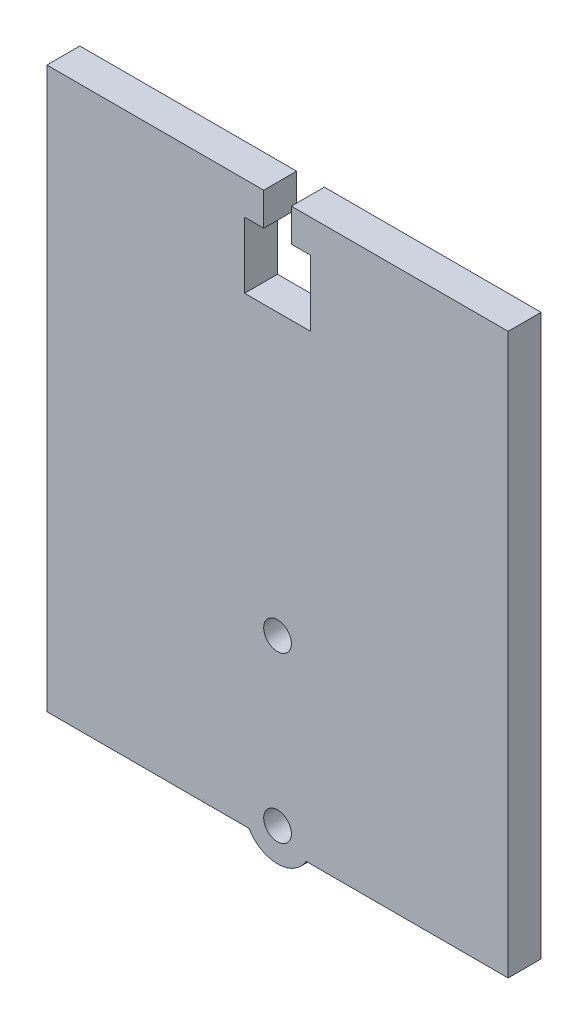
ISO-10303-21;
HEADER;
FILE_DESCRIPTION(('STEP AP214'),'2;1');
FILE_NAME('part.step','',(''),(''),'','','');
FILE_SCHEMA(('AUTOMOTIVE_DESIGN { 1 0 10303 214 1 1 1 1 }'));
ENDSEC;
DATA;
#1=APPLICATION_CONTEXT('core data for automotive mechanical design processes');
#2=APPLICATION_PROTOCOL_DEFINITION('international standard','automotive_design',2000,#1);
#3=PRODUCT_CONTEXT('',#1,'mechanical');
#4=PRODUCT('Part','Part','',(#3));
#5=PRODUCT_RELATED_PRODUCT_CATEGORY('part','',(#4));
#6=PRODUCT_DEFINITION_FORMATION('','',#4);
#7=PRODUCT_DEFINITION_CONTEXT('part definition',#1,'design');
#8=PRODUCT_DEFINITION('design','',#6,#7);
#9=PRODUCT_DEFINITION_SHAPE('','',#8);
#10=(LENGTH_UNIT() NAMED_UNIT(*) SI_UNIT(.MILLI.,.METRE.));
#11=(NAMED_UNIT(*) PLANE_ANGLE_UNIT() SI_UNIT($,.RADIAN.));
#12=(NAMED_UNIT(*) SI_UNIT($,.STERADIAN.) SOLID_ANGLE_UNIT());
#13=UNCERTAINTY_MEASURE_WITH_UNIT(LENGTH_MEASURE(1.E-05),#10,'distance_accuracy_value','');
#14=(GEOMETRIC_REPRESENTATION_CONTEXT(3) GLOBAL_UNCERTAINTY_ASSIGNED_CONTEXT((#13)) GLOBAL_UNIT_ASSIGNED_CONTEXT((#10,
#11,#12)) REPRESENTATION_CONTEXT('',''));
#15=CARTESIAN_POINT('',(0.,0.,0.));
#16=DIRECTION('',(0.,0.,1.));
#17=DIRECTION('',(1.,0.,0.));
#18=AXIS2_PLACEMENT_3D('',#15,#16,#17);
#19=CARTESIAN_POINT('',(35.,-42.5,5.));
#20=DIRECTION('',(0.,1.,0.));
#21=DIRECTION('',(-1.,0.,0.));
#22=AXIS2_PLACEMENT_3D('',#19,#20,#21);
#23=PLANE('',#22);
#24=DIRECTION('',(1.,0.,0.));
#25=VECTOR('',#24,1.);
#26=CARTESIAN_POINT('',(35.,-42.5,0.));
#27=LINE('',#26,#25);
#28=CARTESIAN_POINT('',(-35.,-42.5,0.));
#29=VERTEX_POINT('',#28);
#30=CARTESIAN_POINT('',(-4.33012701892152,-42.5,0.));
#31=VERTEX_POINT('',#30);
#32=EDGE_CURVE('E147',#29,#31,#27,.T.);
#33=ORIENTED_EDGE('',*,*,#32,.T.);
#34=DIRECTION('',(0.,0.,1.));
#35=VECTOR('',#34,1.);
#36=CARTESIAN_POINT('',(-4.33012701892152,-42.5,0.));
#37=LINE('',#36,#35);
#38=CARTESIAN_POINT('',(-4.33012701892152,-42.5,5.));
#39=VERTEX_POINT('',#38);
#40=EDGE_CURVE('E60',#31,#39,#37,.T.);
#41=ORIENTED_EDGE('',*,*,#40,.T.);
#42=DIRECTION('',(1.,0.,0.));
#43=VECTOR('',#42,1.);
#44=CARTESIAN_POINT('',(35.,-42.5,5.));
#45=LINE('',#44,#43);
#46=CARTESIAN_POINT('',(-35.,-42.5,5.));
#47=VERTEX_POINT('',#46);
#48=EDGE_CURVE('E235',#47,#39,#45,.T.);
#49=ORIENTED_EDGE('',*,*,#48,.F.);
#50=DIRECTION('',(0.,0.,-1.));
#51=VECTOR('',#50,1.);
#52=CARTESIAN_POINT('',(-35.,-42.5,5.));
#53=LINE('',#52,#51);
#54=EDGE_CURVE('E11',#47,#29,#53,.T.);
#55=ORIENTED_EDGE('',*,*,#54,.T.);
#56=EDGE_LOOP('',(#33,#41,#49,#55));
#57=FACE_BOUND('',#56,.T.);
#58=ADVANCED_FACE('F37',(#57),#23,.F.);
#59=CARTESIAN_POINT('',(35.,42.5,5.));
#60=DIRECTION('',(0.,-1.,0.));
#61=DIRECTION('',(1.,0.,0.));
#62=AXIS2_PLACEMENT_3D('',#59,#60,#61);
#63=PLANE('',#62);
#64=DIRECTION('',(-1.,0.,0.));
#65=VECTOR('',#64,1.);
#66=CARTESIAN_POINT('',(35.,42.5,0.));
#67=LINE('',#66,#65);
#68=CARTESIAN_POINT('',(35.,42.5,0.));
#69=VERTEX_POINT('',#68);
#70=CARTESIAN_POINT('',(2.1,42.5,0.));
#71=VERTEX_POINT('',#70);
#72=EDGE_CURVE('E234',#69,#71,#67,.T.);
#73=ORIENTED_EDGE('',*,*,#72,.T.);
#74=DIRECTION('',(0.,0.,1.));
#75=VECTOR('',#74,1.);
#76=CARTESIAN_POINT('',(2.1,42.5,0.));
#77=LINE('',#76,#75);
#78=CARTESIAN_POINT('',(2.1,42.5,5.));
#79=VERTEX_POINT('',#78);
#80=EDGE_CURVE('E205',#71,#79,#77,.T.);
#81=ORIENTED_EDGE('',*,*,#80,.T.);
#82=DIRECTION('',(-1.,0.,0.));
#83=VECTOR('',#82,1.);
#84=CARTESIAN_POINT('',(35.,42.5,5.));
#85=LINE('',#84,#83);
#86=CARTESIAN_POINT('',(35.,42.5,5.));
#87=VERTEX_POINT('',#86);
#88=EDGE_CURVE('E240',#87,#79,#85,.T.);
#89=ORIENTED_EDGE('',*,*,#88,.F.);
#90=DIRECTION('',(0.,0.,-1.));
#91=VECTOR('',#90,1.);
#92=CARTESIAN_POINT('',(35.,42.5,5.));
#93=LINE('',#92,#91);
#94=EDGE_CURVE('E252',#87,#69,#93,.T.);
#95=ORIENTED_EDGE('',*,*,#94,.T.);
#96=EDGE_LOOP('',(#73,#81,#89,#95));
#97=FACE_BOUND('',#96,.T.);
#98=ADVANCED_FACE('F300',(#97),#63,.F.);
#99=CARTESIAN_POINT('',(-35.,-42.5,5.));
#100=DIRECTION('',(1.,0.,0.));
#101=DIRECTION('',(0.,0.,-1.));
#102=AXIS2_PLACEMENT_3D('',#99,#100,#101);
#103=PLANE('',#102);
#104=DIRECTION('',(0.,-1.,0.));
#105=VECTOR('',#104,1.);
#106=CARTESIAN_POINT('',(-35.,-42.5,0.));
#107=LINE('',#106,#105);
#108=CARTESIAN_POINT('',(-35.,42.5,0.));
#109=VERTEX_POINT('',#108);
#110=EDGE_CURVE('E148',#109,#29,#107,.T.);
#111=ORIENTED_EDGE('',*,*,#110,.T.);
#112=ORIENTED_EDGE('',*,*,#54,.F.);
#113=DIRECTION('',(0.,-1.,0.));
#114=VECTOR('',#113,1.);
#115=CARTESIAN_POINT('',(-35.,-42.5,5.));
#116=LINE('',#115,#114);
#117=CARTESIAN_POINT('',(-35.,42.5,5.));
#118=VERTEX_POINT('',#117);
#119=EDGE_CURVE('E231',#118,#47,#116,.T.);
#120=ORIENTED_EDGE('',*,*,#119,.F.);
#121=DIRECTION('',(0.,0.,-1.));
#122=VECTOR('',#121,1.);
#123=CARTESIAN_POINT('',(-35.,42.5,5.));
#124=LINE('',#123,#122);
#125=EDGE_CURVE('E243',#118,#109,#124,.T.);
#126=ORIENTED_EDGE('',*,*,#125,.T.);
#127=EDGE_LOOP('',(#111,#112,#120,#126));
#128=FACE_BOUND('',#127,.T.);
#129=ADVANCED_FACE('F39',(#128),#103,.F.);
#130=CARTESIAN_POINT('',(4.3301270189215,-42.5,5.));
#131=VERTEX_POINT('',#130);
#132=CARTESIAN_POINT('',(35.,-42.5,5.));
#133=VERTEX_POINT('',#132);
#134=EDGE_CURVE('E52',#131,#133,#45,.T.);
#135=ORIENTED_EDGE('',*,*,#134,.F.);
#136=DIRECTION('',(0.,0.,1.));
#137=VECTOR('',#136,1.);
#138=CARTESIAN_POINT('',(4.3301270189215,-42.5,0.));
#139=LINE('',#138,#137);
#140=CARTESIAN_POINT('',(4.3301270189215,-42.5,0.));
#141=VERTEX_POINT('',#140);
#142=EDGE_CURVE('E150',#141,#131,#139,.T.);
#143=ORIENTED_EDGE('',*,*,#142,.F.);
#144=CARTESIAN_POINT('',(35.,-42.5,0.));
#145=VERTEX_POINT('',#144);
#146=EDGE_CURVE('E139',#141,#145,#27,.T.);
#147=ORIENTED_EDGE('',*,*,#146,.T.);
#148=DIRECTION('',(0.,0.,-1.));
#149=VECTOR('',#148,1.);
#150=CARTESIAN_POINT('',(35.,-42.5,5.));
#151=LINE('',#150,#149);
#152=EDGE_CURVE('E45',#133,#145,#151,.T.);
#153=ORIENTED_EDGE('',*,*,#152,.F.);
#154=EDGE_LOOP('',(#135,#143,#147,#153));
#155=FACE_BOUND('',#154,.T.);
#156=ADVANCED_FACE('F151',(#155),#23,.F.);
#157=CARTESIAN_POINT('',(35.,-42.5,5.));
#158=DIRECTION('',(-1.,0.,0.));
#159=DIRECTION('',(0.,0.,1.));
#160=AXIS2_PLACEMENT_3D('',#157,#158,#159);
#161=PLANE('',#160);
#162=DIRECTION('',(0.,1.,0.));
#163=VECTOR('',#162,1.);
#164=CARTESIAN_POINT('',(35.,-42.5,0.));
#165=LINE('',#164,#163);
#166=EDGE_CURVE('E145',#145,#69,#165,.T.);
#167=ORIENTED_EDGE('',*,*,#166,.T.);
#168=ORIENTED_EDGE('',*,*,#94,.F.);
#169=DIRECTION('',(0.,1.,0.));
#170=VECTOR('',#169,1.);
#171=CARTESIAN_POINT('',(35.,-42.5,5.));
#172=LINE('',#171,#170);
#173=EDGE_CURVE('E237',#133,#87,#172,.T.);
#174=ORIENTED_EDGE('',*,*,#173,.F.);
#175=ORIENTED_EDGE('',*,*,#152,.T.);
#176=EDGE_LOOP('',(#167,#168,#174,#175));
#177=FACE_BOUND('',#176,.T.);
#178=ADVANCED_FACE('F256',(#177),#161,.F.);
#179=CARTESIAN_POINT('',(-2.10000000000003,42.5,5.));
#180=VERTEX_POINT('',#179);
#181=EDGE_CURVE('E239',#180,#118,#85,.T.);
#182=ORIENTED_EDGE('',*,*,#181,.F.);
#183=DIRECTION('',(0.,0.,1.));
#184=VECTOR('',#183,1.);
#185=CARTESIAN_POINT('',(-2.10000000000003,42.5,0.));
#186=LINE('',#185,#184);
#187=CARTESIAN_POINT('',(-2.10000000000003,42.5,0.));
#188=VERTEX_POINT('',#187);
#189=EDGE_CURVE('E184',#188,#180,#186,.T.);
#190=ORIENTED_EDGE('',*,*,#189,.F.);
#191=EDGE_CURVE('E247',#188,#109,#67,.T.);
#192=ORIENTED_EDGE('',*,*,#191,.T.);
#193=ORIENTED_EDGE('',*,*,#125,.F.);
#194=EDGE_LOOP('',(#182,#190,#192,#193));
#195=FACE_BOUND('',#194,.T.);
#196=ADVANCED_FACE('F272',(#195),#63,.F.);
#197=CARTESIAN_POINT('',(0.,0.,5.));
#198=DIRECTION('',(0.,0.,1.));
#199=DIRECTION('',(1.,0.,0.));
#200=AXIS2_PLACEMENT_3D('',#197,#198,#199);
#201=PLANE('',#200);
#202=DIRECTION('',(0.,1.,0.));
#203=VECTOR('',#202,1.);
#204=CARTESIAN_POINT('',(2.1,42.5,5.));
#205=LINE('',#204,#203);
#206=CARTESIAN_POINT('',(2.1,37.5,5.));
#207=VERTEX_POINT('',#206);
#208=EDGE_CURVE('E167',#207,#79,#205,.T.);
#209=ORIENTED_EDGE('',*,*,#208,.F.);
#210=DIRECTION('',(-1.,0.,0.));
#211=VECTOR('',#210,1.);
#212=CARTESIAN_POINT('',(2.1,37.5,5.));
#213=LINE('',#212,#211);
#214=CARTESIAN_POINT('',(5.,37.5,5.));
#215=VERTEX_POINT('',#214);
#216=EDGE_CURVE('E201',#215,#207,#213,.T.);
#217=ORIENTED_EDGE('',*,*,#216,.F.);
#218=DIRECTION('',(0.,1.,0.));
#219=VECTOR('',#218,1.);
#220=CARTESIAN_POINT('',(5.,37.5,5.));
#221=LINE('',#220,#219);
#222=CARTESIAN_POINT('',(5.,27.5,5.));
#223=VERTEX_POINT('',#222);
#224=EDGE_CURVE('E198',#223,#215,#221,.T.);
#225=ORIENTED_EDGE('',*,*,#224,.F.);
#226=DIRECTION('',(1.,0.,0.));
#227=VECTOR('',#226,1.);
#228=CARTESIAN_POINT('',(5.,27.5,5.));
#229=LINE('',#228,#227);
#230=CARTESIAN_POINT('',(-5.,27.5,5.));
#231=VERTEX_POINT('',#230);
#232=EDGE_CURVE('E195',#231,#223,#229,.T.);
#233=ORIENTED_EDGE('',*,*,#232,.F.);
#234=DIRECTION('',(0.,-1.,0.));
#235=VECTOR('',#234,1.);
#236=CARTESIAN_POINT('',(-5.00000000000002,37.5,5.));
#237=LINE('',#236,#235);
#238=CARTESIAN_POINT('',(-5.00000000000002,37.5,5.));
#239=VERTEX_POINT('',#238);
#240=EDGE_CURVE('E192',#239,#231,#237,.T.);
#241=ORIENTED_EDGE('',*,*,#240,.F.);
#242=DIRECTION('',(-1.,0.,0.));
#243=VECTOR('',#242,1.);
#244=CARTESIAN_POINT('',(-2.10000000000002,37.5,5.));
#245=LINE('',#244,#243);
#246=CARTESIAN_POINT('',(-2.10000000000002,37.5,5.));
#247=VERTEX_POINT('',#246);
#248=EDGE_CURVE('E188',#247,#239,#245,.T.);
#249=ORIENTED_EDGE('',*,*,#248,.F.);
#250=DIRECTION('',(0.,-1.,0.));
#251=VECTOR('',#250,1.);
#252=CARTESIAN_POINT('',(-2.10000000000003,42.5,5.));
#253=LINE('',#252,#251);
#254=EDGE_CURVE('E185',#180,#247,#253,.T.);
#255=ORIENTED_EDGE('',*,*,#254,.F.);
#256=ORIENTED_EDGE('',*,*,#181,.T.);
#257=ORIENTED_EDGE('',*,*,#119,.T.);
#258=ORIENTED_EDGE('',*,*,#48,.T.);
#259=CARTESIAN_POINT('',(0.,-39.9999999999988,5.));
#260=DIRECTION('',(0.,0.,1.));
#261=DIRECTION('',(1.,0.,0.));
#262=AXIS2_PLACEMENT_3D('',#259,#260,#261);
#263=CIRCLE('',#262,5.);
#264=EDGE_CURVE('E157',#39,#131,#263,.T.);
#265=ORIENTED_EDGE('',*,*,#264,.T.);
#266=ORIENTED_EDGE('',*,*,#134,.T.);
#267=ORIENTED_EDGE('',*,*,#173,.T.);
#268=ORIENTED_EDGE('',*,*,#88,.T.);
#269=EDGE_LOOP('',(#209,#217,#225,#233,#241,#249,#255,#256,#257,#258,#265,#266,#267,#268));
#270=FACE_BOUND('',#269,.T.);
#271=CARTESIAN_POINT('',(0.,-14.9999999999988,5.));
#272=DIRECTION('',(0.,0.,1.));
#273=DIRECTION('',(1.,0.,0.));
#274=AXIS2_PLACEMENT_3D('',#271,#272,#273);
#275=CIRCLE('',#274,2.1);
#276=CARTESIAN_POINT('',(2.09999999999999,-14.9999999999988,5.));
#277=VERTEX_POINT('',#276);
#278=EDGE_CURVE('E223',#277,#277,#275,.T.);
#279=ORIENTED_EDGE('',*,*,#278,.F.);
#280=EDGE_LOOP('',(#279));
#281=FACE_BOUND('',#280,.T.);
#282=CARTESIAN_POINT('',(0.,-39.9999999999988,5.));
#283=DIRECTION('',(0.,0.,1.));
#284=DIRECTION('',(1.,0.,0.));
#285=AXIS2_PLACEMENT_3D('',#282,#283,#284);
#286=CIRCLE('',#285,2.1);
#287=CARTESIAN_POINT('',(2.09999999999999,-39.9999999999988,5.));
#288=VERTEX_POINT('',#287);
#289=EDGE_CURVE('E161',#288,#288,#286,.T.);
#290=ORIENTED_EDGE('',*,*,#289,.F.);
#291=EDGE_LOOP('',(#290));
#292=FACE_BOUND('',#291,.T.);
#293=ADVANCED_FACE('F261',(#270,#281,#292),#201,.T.);
#294=CARTESIAN_POINT('',(0.,0.,0.));
#295=DIRECTION('',(0.,0.,1.));
#296=DIRECTION('',(1.,0.,0.));
#297=AXIS2_PLACEMENT_3D('',#294,#295,#296);
#298=PLANE('',#297);
#299=CARTESIAN_POINT('',(0.,-14.9999999999988,0.));
#300=DIRECTION('',(0.,0.,1.));
#301=DIRECTION('',(1.,0.,0.));
#302=AXIS2_PLACEMENT_3D('',#299,#300,#301);
#303=CIRCLE('',#302,2.1);
#304=CARTESIAN_POINT('',(2.09999999999999,-14.9999999999988,0.));
#305=VERTEX_POINT('',#304);
#306=EDGE_CURVE('E189',#305,#305,#303,.T.);
#307=ORIENTED_EDGE('',*,*,#306,.T.);
#308=EDGE_LOOP('',(#307));
#309=FACE_BOUND('',#308,.T.);
#310=CARTESIAN_POINT('',(0.,-39.9999999999988,0.));
#311=DIRECTION('',(0.,0.,1.));
#312=DIRECTION('',(1.,0.,0.));
#313=AXIS2_PLACEMENT_3D('',#310,#311,#312);
#314=CIRCLE('',#313,2.1);
#315=CARTESIAN_POINT('',(2.09999999999999,-39.9999999999988,0.));
#316=VERTEX_POINT('',#315);
#317=EDGE_CURVE('E226',#316,#316,#314,.T.);
#318=ORIENTED_EDGE('',*,*,#317,.T.);
#319=EDGE_LOOP('',(#318));
#320=FACE_BOUND('',#319,.T.);
#321=DIRECTION('',(-1.,0.,0.));
#322=VECTOR('',#321,1.);
#323=CARTESIAN_POINT('',(2.1,37.5,0.));
#324=LINE('',#323,#322);
#325=CARTESIAN_POINT('',(5.,37.5,0.));
#326=VERTEX_POINT('',#325);
#327=CARTESIAN_POINT('',(2.1,37.5,0.));
#328=VERTEX_POINT('',#327);
#329=EDGE_CURVE('E179',#326,#328,#324,.T.);
#330=ORIENTED_EDGE('',*,*,#329,.T.);
#331=DIRECTION('',(0.,1.,0.));
#332=VECTOR('',#331,1.);
#333=CARTESIAN_POINT('',(2.1,42.5,0.));
#334=LINE('',#333,#332);
#335=EDGE_CURVE('E181',#328,#71,#334,.T.);
#336=ORIENTED_EDGE('',*,*,#335,.T.);
#337=ORIENTED_EDGE('',*,*,#72,.F.);
#338=ORIENTED_EDGE('',*,*,#166,.F.);
#339=ORIENTED_EDGE('',*,*,#146,.F.);
#340=CARTESIAN_POINT('',(0.,-39.9999999999988,0.));
#341=DIRECTION('',(0.,0.,1.));
#342=DIRECTION('',(1.,0.,0.));
#343=AXIS2_PLACEMENT_3D('',#340,#341,#342);
#344=CIRCLE('',#343,5.);
#345=EDGE_CURVE('E143',#31,#141,#344,.T.);
#346=ORIENTED_EDGE('',*,*,#345,.F.);
#347=ORIENTED_EDGE('',*,*,#32,.F.);
#348=ORIENTED_EDGE('',*,*,#110,.F.);
#349=ORIENTED_EDGE('',*,*,#191,.F.);
#350=DIRECTION('',(0.,-1.,0.));
#351=VECTOR('',#350,1.);
#352=CARTESIAN_POINT('',(-2.10000000000003,42.5,0.));
#353=LINE('',#352,#351);
#354=CARTESIAN_POINT('',(-2.10000000000002,37.5,0.));
#355=VERTEX_POINT('',#354);
#356=EDGE_CURVE('E163',#188,#355,#353,.T.);
#357=ORIENTED_EDGE('',*,*,#356,.T.);
#358=DIRECTION('',(-1.,0.,0.));
#359=VECTOR('',#358,1.);
#360=CARTESIAN_POINT('',(-2.10000000000002,37.5,0.));
#361=LINE('',#360,#359);
#362=CARTESIAN_POINT('',(-5.00000000000002,37.5,0.));
#363=VERTEX_POINT('',#362);
#364=EDGE_CURVE('E166',#355,#363,#361,.T.);
#365=ORIENTED_EDGE('',*,*,#364,.T.);
#366=DIRECTION('',(0.,-1.,0.));
#367=VECTOR('',#366,1.);
#368=CARTESIAN_POINT('',(-5.00000000000002,37.5,0.));
#369=LINE('',#368,#367);
#370=CARTESIAN_POINT('',(-5.,27.5,0.));
#371=VERTEX_POINT('',#370);
#372=EDGE_CURVE('E170',#363,#371,#369,.T.);
#373=ORIENTED_EDGE('',*,*,#372,.T.);
#374=DIRECTION('',(1.,0.,0.));
#375=VECTOR('',#374,1.);
#376=CARTESIAN_POINT('',(5.,27.5,0.));
#377=LINE('',#376,#375);
#378=CARTESIAN_POINT('',(5.,27.5,0.));
#379=VERTEX_POINT('',#378);
#380=EDGE_CURVE('E173',#371,#379,#377,.T.);
#381=ORIENTED_EDGE('',*,*,#380,.T.);
#382=DIRECTION('',(0.,1.,0.));
#383=VECTOR('',#382,1.);
#384=CARTESIAN_POINT('',(5.,37.5,0.));
#385=LINE('',#384,#383);
#386=EDGE_CURVE('E176',#379,#326,#385,.T.);
#387=ORIENTED_EDGE('',*,*,#386,.T.);
#388=EDGE_LOOP('',(#330,#336,#337,#338,#339,#346,#347,#348,#349,#357,#365,#373,#381,#387));
#389=FACE_BOUND('',#388,.T.);
#390=ADVANCED_FACE('F141',(#309,#320,#389),#298,.F.);
#391=CARTESIAN_POINT('',(0.,-39.9999999999988,0.));
#392=DIRECTION('',(0.,0.,1.));
#393=DIRECTION('',(1.,0.,0.));
#394=AXIS2_PLACEMENT_3D('',#391,#392,#393);
#395=CYLINDRICAL_SURFACE('',#394,2.1);
#396=ORIENTED_EDGE('',*,*,#317,.F.);
#397=EDGE_LOOP('',(#396));
#398=FACE_BOUND('',#397,.T.);
#399=ORIENTED_EDGE('',*,*,#289,.T.);
#400=EDGE_LOOP('',(#399));
#401=FACE_BOUND('',#400,.T.);
#402=ADVANCED_FACE('F339',(#398,#401),#395,.F.);
#403=CARTESIAN_POINT('',(0.,-14.9999999999988,0.));
#404=DIRECTION('',(0.,0.,1.));
#405=DIRECTION('',(1.,0.,0.));
#406=AXIS2_PLACEMENT_3D('',#403,#404,#405);
#407=CYLINDRICAL_SURFACE('',#406,2.1);
#408=ORIENTED_EDGE('',*,*,#306,.F.);
#409=EDGE_LOOP('',(#408));
#410=FACE_BOUND('',#409,.T.);
#411=ORIENTED_EDGE('',*,*,#278,.T.);
#412=EDGE_LOOP('',(#411));
#413=FACE_BOUND('',#412,.T.);
#414=ADVANCED_FACE('F392',(#410,#413),#407,.F.);
#415=CARTESIAN_POINT('',(2.1,42.5,0.));
#416=DIRECTION('',(1.,0.,0.));
#417=DIRECTION('',(0.,1.,0.));
#418=AXIS2_PLACEMENT_3D('',#415,#416,#417);
#419=PLANE('',#418);
#420=ORIENTED_EDGE('',*,*,#208,.T.);
#421=ORIENTED_EDGE('',*,*,#80,.F.);
#422=ORIENTED_EDGE('',*,*,#335,.F.);
#423=DIRECTION('',(0.,0.,1.));
#424=VECTOR('',#423,1.);
#425=CARTESIAN_POINT('',(2.1,37.5,0.));
#426=LINE('',#425,#424);
#427=EDGE_CURVE('E208',#328,#207,#426,.T.);
#428=ORIENTED_EDGE('',*,*,#427,.T.);
#429=EDGE_LOOP('',(#420,#421,#422,#428));
#430=FACE_BOUND('',#429,.T.);
#431=ADVANCED_FACE('F298',(#430),#419,.F.);
#432=CARTESIAN_POINT('',(2.1,37.5,0.));
#433=DIRECTION('',(0.,1.,0.));
#434=DIRECTION('',(0.,0.,1.));
#435=AXIS2_PLACEMENT_3D('',#432,#433,#434);
#436=PLANE('',#435);
#437=ORIENTED_EDGE('',*,*,#216,.T.);
#438=ORIENTED_EDGE('',*,*,#427,.F.);
#439=ORIENTED_EDGE('',*,*,#329,.F.);
#440=DIRECTION('',(0.,0.,1.));
#441=VECTOR('',#440,1.);
#442=CARTESIAN_POINT('',(5.,37.5,0.));
#443=LINE('',#442,#441);
#444=EDGE_CURVE('E210',#326,#215,#443,.T.);
#445=ORIENTED_EDGE('',*,*,#444,.T.);
#446=EDGE_LOOP('',(#437,#438,#439,#445));
#447=FACE_BOUND('',#446,.T.);
#448=ADVANCED_FACE('F295',(#447),#436,.F.);
#449=CARTESIAN_POINT('',(5.,37.5,0.));
#450=DIRECTION('',(1.,0.,0.));
#451=DIRECTION('',(0.,0.,-1.));
#452=AXIS2_PLACEMENT_3D('',#449,#450,#451);
#453=PLANE('',#452);
#454=ORIENTED_EDGE('',*,*,#224,.T.);
#455=ORIENTED_EDGE('',*,*,#444,.F.);
#456=ORIENTED_EDGE('',*,*,#386,.F.);
#457=DIRECTION('',(0.,0.,1.));
#458=VECTOR('',#457,1.);
#459=CARTESIAN_POINT('',(5.,27.5,0.));
#460=LINE('',#459,#458);
#461=EDGE_CURVE('E212',#379,#223,#460,.T.);
#462=ORIENTED_EDGE('',*,*,#461,.T.);
#463=EDGE_LOOP('',(#454,#455,#456,#462));
#464=FACE_BOUND('',#463,.T.);
#465=ADVANCED_FACE('F291',(#464),#453,.F.);
#466=CARTESIAN_POINT('',(5.,27.5,0.));
#467=DIRECTION('',(0.,-1.,0.));
#468=DIRECTION('',(1.,0.,0.));
#469=AXIS2_PLACEMENT_3D('',#466,#467,#468);
#470=PLANE('',#469);
#471=ORIENTED_EDGE('',*,*,#232,.T.);
#472=ORIENTED_EDGE('',*,*,#461,.F.);
#473=ORIENTED_EDGE('',*,*,#380,.F.);
#474=DIRECTION('',(0.,0.,1.));
#475=VECTOR('',#474,1.);
#476=CARTESIAN_POINT('',(-5.,27.5,0.));
#477=LINE('',#476,#475);
#478=EDGE_CURVE('E214',#371,#231,#477,.T.);
#479=ORIENTED_EDGE('',*,*,#478,.T.);
#480=EDGE_LOOP('',(#471,#472,#473,#479));
#481=FACE_BOUND('',#480,.T.);
#482=ADVANCED_FACE('F287',(#481),#470,.F.);
#483=CARTESIAN_POINT('',(-5.00000000000002,37.5,0.));
#484=DIRECTION('',(-1.,0.,0.));
#485=DIRECTION('',(0.,-1.,0.));
#486=AXIS2_PLACEMENT_3D('',#483,#484,#485);
#487=PLANE('',#486);
#488=ORIENTED_EDGE('',*,*,#240,.T.);
#489=ORIENTED_EDGE('',*,*,#478,.F.);
#490=ORIENTED_EDGE('',*,*,#372,.F.);
#491=DIRECTION('',(0.,0.,1.));
#492=VECTOR('',#491,1.);
#493=CARTESIAN_POINT('',(-5.00000000000002,37.5,0.));
#494=LINE('',#493,#492);
#495=EDGE_CURVE('E216',#363,#239,#494,.T.);
#496=ORIENTED_EDGE('',*,*,#495,.T.);
#497=EDGE_LOOP('',(#488,#489,#490,#496));
#498=FACE_BOUND('',#497,.T.);
#499=ADVANCED_FACE('F285',(#498),#487,.F.);
#500=CARTESIAN_POINT('',(-2.10000000000002,37.5,0.));
#501=DIRECTION('',(0.,1.,0.));
#502=DIRECTION('',(0.,0.,1.));
#503=AXIS2_PLACEMENT_3D('',#500,#501,#502);
#504=PLANE('',#503);
#505=ORIENTED_EDGE('',*,*,#248,.T.);
#506=ORIENTED_EDGE('',*,*,#495,.F.);
#507=ORIENTED_EDGE('',*,*,#364,.F.);
#508=DIRECTION('',(0.,0.,1.));
#509=VECTOR('',#508,1.);
#510=CARTESIAN_POINT('',(-2.10000000000002,37.5,0.));
#511=LINE('',#510,#509);
#512=EDGE_CURVE('E218',#355,#247,#511,.T.);
#513=ORIENTED_EDGE('',*,*,#512,.T.);
#514=EDGE_LOOP('',(#505,#506,#507,#513));
#515=FACE_BOUND('',#514,.T.);
#516=ADVANCED_FACE('F281',(#515),#504,.F.);
#517=CARTESIAN_POINT('',(-2.10000000000003,42.5,0.));
#518=DIRECTION('',(-1.,0.,0.));
#519=DIRECTION('',(0.,-1.,0.));
#520=AXIS2_PLACEMENT_3D('',#517,#518,#519);
#521=PLANE('',#520);
#522=ORIENTED_EDGE('',*,*,#254,.T.);
#523=ORIENTED_EDGE('',*,*,#512,.F.);
#524=ORIENTED_EDGE('',*,*,#356,.F.);
#525=ORIENTED_EDGE('',*,*,#189,.T.);
#526=EDGE_LOOP('',(#522,#523,#524,#525));
#527=FACE_BOUND('',#526,.T.);
#528=ADVANCED_FACE('F275',(#527),#521,.F.);
#529=CARTESIAN_POINT('',(0.,-39.9999999999988,0.));
#530=DIRECTION('',(0.,0.,1.));
#531=DIRECTION('',(1.,0.,0.));
#532=AXIS2_PLACEMENT_3D('',#529,#530,#531);
#533=CYLINDRICAL_SURFACE('',#532,5.);
#534=ORIENTED_EDGE('',*,*,#264,.F.);
#535=ORIENTED_EDGE('',*,*,#40,.F.);
#536=ORIENTED_EDGE('',*,*,#345,.T.);
#537=ORIENTED_EDGE('',*,*,#142,.T.);
#538=EDGE_LOOP('',(#534,#535,#536,#537));
#539=FACE_BOUND('',#538,.T.);
#540=ADVANCED_FACE('F156',(#539),#533,.T.);
#541=CLOSED_SHELL('',(#58,#98,#129,#156,#178,#196,#293,#390,#402,#414,#431,#448,#465,#482,#499,
#516,#528,#540));
#542=MANIFOLD_SOLID_BREP('B2',#541);
#543=ADVANCED_BREP_SHAPE_REPRESENTATION('',(#18,#542),#14);
#544=SHAPE_DEFINITION_REPRESENTATION(#9,#543);
ENDSEC;
END-ISO-10303-21;
